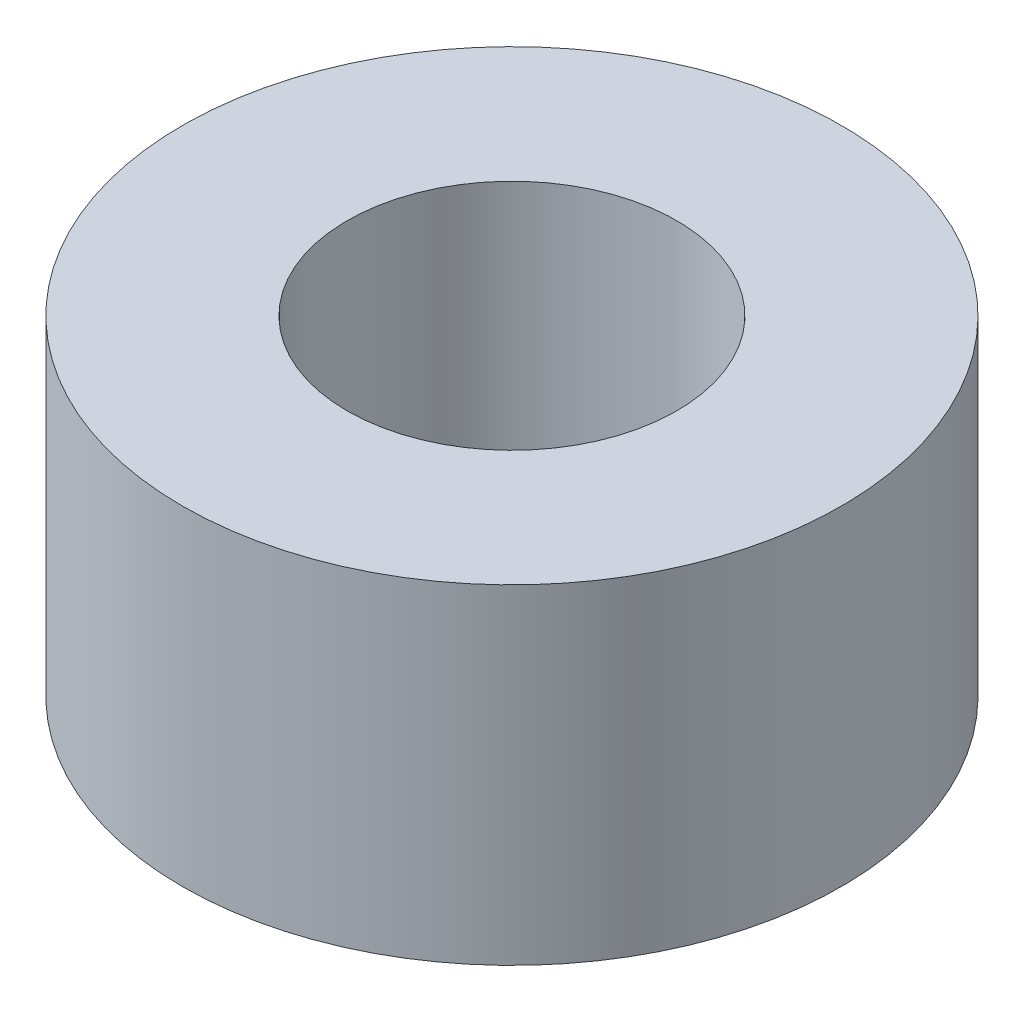
ISO-10303-21;
HEADER;
FILE_DESCRIPTION(('STEP AP214'),'2;1');
FILE_NAME('part.step','',(''),(''),'','','');
FILE_SCHEMA(('AUTOMOTIVE_DESIGN { 1 0 10303 214 1 1 1 1 }'));
ENDSEC;
DATA;
#1=APPLICATION_CONTEXT('core data for automotive mechanical design processes');
#2=APPLICATION_PROTOCOL_DEFINITION('international standard','automotive_design',2000,#1);
#3=PRODUCT_CONTEXT('',#1,'mechanical');
#4=PRODUCT('Part','Part','',(#3));
#5=PRODUCT_RELATED_PRODUCT_CATEGORY('part','',(#4));
#6=PRODUCT_DEFINITION_FORMATION('','',#4);
#7=PRODUCT_DEFINITION_CONTEXT('part definition',#1,'design');
#8=PRODUCT_DEFINITION('design','',#6,#7);
#9=PRODUCT_DEFINITION_SHAPE('','',#8);
#10=(LENGTH_UNIT() NAMED_UNIT(*) SI_UNIT(.MILLI.,.METRE.));
#11=(NAMED_UNIT(*) PLANE_ANGLE_UNIT() SI_UNIT($,.RADIAN.));
#12=(NAMED_UNIT(*) SI_UNIT($,.STERADIAN.) SOLID_ANGLE_UNIT());
#13=UNCERTAINTY_MEASURE_WITH_UNIT(LENGTH_MEASURE(1.E-05),#10,'distance_accuracy_value','');
#14=(GEOMETRIC_REPRESENTATION_CONTEXT(3) GLOBAL_UNCERTAINTY_ASSIGNED_CONTEXT((#13)) GLOBAL_UNIT_ASSIGNED_CONTEXT((#10,
#11,#12)) REPRESENTATION_CONTEXT('',''));
#15=CARTESIAN_POINT('',(0.,0.,0.));
#16=DIRECTION('',(0.,0.,1.));
#17=DIRECTION('',(1.,0.,0.));
#18=AXIS2_PLACEMENT_3D('',#15,#16,#17);
#19=CARTESIAN_POINT('',(0.,3.175,0.));
#20=DIRECTION('',(0.,1.,0.));
#21=DIRECTION('',(0.,0.,1.));
#22=AXIS2_PLACEMENT_3D('',#19,#20,#21);
#23=PLANE('',#22);
#24=CARTESIAN_POINT('',(0.,3.175,0.));
#25=DIRECTION('',(0.,1.,0.));
#26=DIRECTION('',(0.,0.,1.));
#27=AXIS2_PLACEMENT_3D('',#24,#25,#26);
#28=CIRCLE('',#27,3.175);
#29=CARTESIAN_POINT('',(0.,3.175,3.175));
#30=VERTEX_POINT('',#29);
#31=EDGE_CURVE('E10',#30,#30,#28,.T.);
#32=ORIENTED_EDGE('',*,*,#31,.T.);
#33=EDGE_LOOP('',(#32));
#34=FACE_BOUND('',#33,.T.);
#35=CARTESIAN_POINT('',(0.,3.175,0.));
#36=DIRECTION('',(0.,1.,0.));
#37=DIRECTION('',(0.,0.,1.));
#38=AXIS2_PLACEMENT_3D('',#35,#36,#37);
#39=CIRCLE('',#38,1.5875);
#40=CARTESIAN_POINT('',(0.,3.175,1.5875));
#41=VERTEX_POINT('',#40);
#42=EDGE_CURVE('E42',#41,#41,#39,.T.);
#43=ORIENTED_EDGE('',*,*,#42,.F.);
#44=EDGE_LOOP('',(#43));
#45=FACE_BOUND('',#44,.T.);
#46=ADVANCED_FACE('F31',(#34,#45),#23,.T.);
#47=CARTESIAN_POINT('',(0.,0.,0.));
#48=DIRECTION('',(0.,1.,0.));
#49=DIRECTION('',(0.,0.,1.));
#50=AXIS2_PLACEMENT_3D('',#47,#48,#49);
#51=PLANE('',#50);
#52=CARTESIAN_POINT('',(0.,0.,0.));
#53=DIRECTION('',(0.,1.,0.));
#54=DIRECTION('',(0.,0.,1.));
#55=AXIS2_PLACEMENT_3D('',#52,#53,#54);
#56=CIRCLE('',#55,3.175);
#57=CARTESIAN_POINT('',(0.,0.,3.175));
#58=VERTEX_POINT('',#57);
#59=EDGE_CURVE('E35',#58,#58,#56,.T.);
#60=ORIENTED_EDGE('',*,*,#59,.F.);
#61=EDGE_LOOP('',(#60));
#62=FACE_BOUND('',#61,.T.);
#63=CARTESIAN_POINT('',(0.,0.,0.));
#64=DIRECTION('',(0.,1.,0.));
#65=DIRECTION('',(0.,0.,1.));
#66=AXIS2_PLACEMENT_3D('',#63,#64,#65);
#67=CIRCLE('',#66,1.5875);
#68=CARTESIAN_POINT('',(0.,0.,1.5875));
#69=VERTEX_POINT('',#68);
#70=EDGE_CURVE('E44',#69,#69,#67,.T.);
#71=ORIENTED_EDGE('',*,*,#70,.T.);
#72=EDGE_LOOP('',(#71));
#73=FACE_BOUND('',#72,.T.);
#74=ADVANCED_FACE('F54',(#62,#73),#51,.F.);
#75=CARTESIAN_POINT('',(0.,3.175,0.));
#76=DIRECTION('',(0.,-1.,0.));
#77=DIRECTION('',(0.,0.,-1.));
#78=AXIS2_PLACEMENT_3D('',#75,#76,#77);
#79=CYLINDRICAL_SURFACE('',#78,3.175);
#80=ORIENTED_EDGE('',*,*,#31,.F.);
#81=EDGE_LOOP('',(#80));
#82=FACE_BOUND('',#81,.T.);
#83=ORIENTED_EDGE('',*,*,#59,.T.);
#84=EDGE_LOOP('',(#83));
#85=FACE_BOUND('',#84,.T.);
#86=ADVANCED_FACE('F33',(#82,#85),#79,.T.);
#87=CARTESIAN_POINT('',(0.,3.175,0.));
#88=DIRECTION('',(0.,-1.,0.));
#89=DIRECTION('',(0.,0.,-1.));
#90=AXIS2_PLACEMENT_3D('',#87,#88,#89);
#91=CYLINDRICAL_SURFACE('',#90,1.5875);
#92=ORIENTED_EDGE('',*,*,#42,.T.);
#93=EDGE_LOOP('',(#92));
#94=FACE_BOUND('',#93,.T.);
#95=ORIENTED_EDGE('',*,*,#70,.F.);
#96=EDGE_LOOP('',(#95));
#97=FACE_BOUND('',#96,.T.);
#98=ADVANCED_FACE('F50',(#94,#97),#91,.F.);
#99=CLOSED_SHELL('',(#46,#74,#86,#98));
#100=MANIFOLD_SOLID_BREP('B2',#99);
#101=ADVANCED_BREP_SHAPE_REPRESENTATION('',(#18,#100),#14);
#102=SHAPE_DEFINITION_REPRESENTATION(#9,#101);
ENDSEC;
END-ISO-10303-21;
